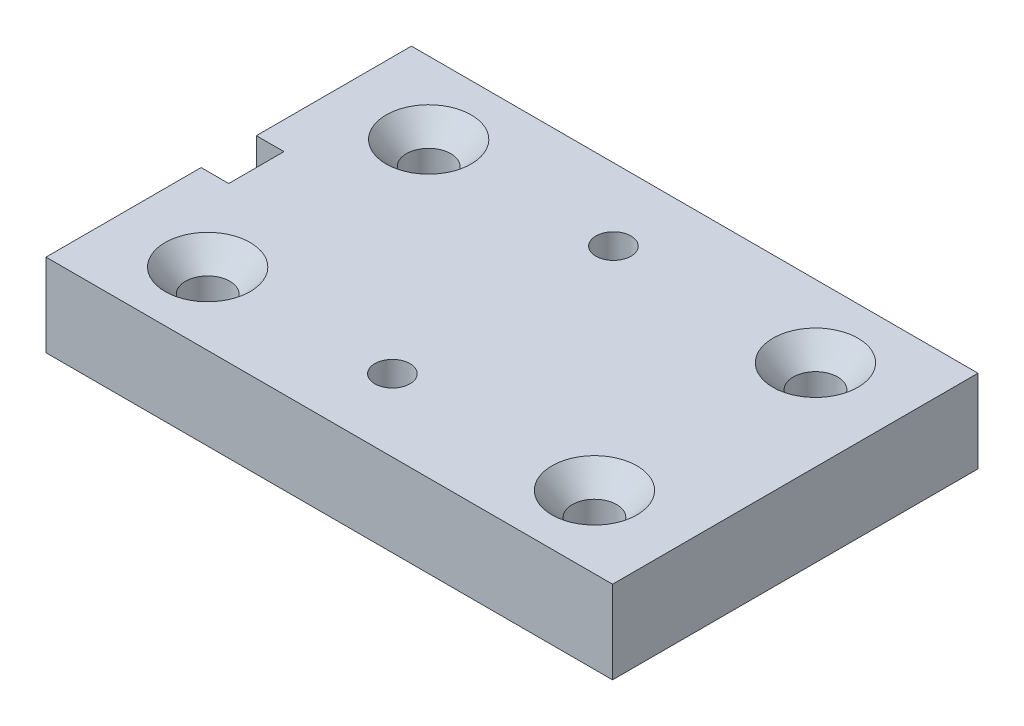
ISO-10303-21;
HEADER;
FILE_DESCRIPTION(('STEP AP214'),'2;1');
FILE_NAME('part.step','',(''),(''),'','','');
FILE_SCHEMA(('AUTOMOTIVE_DESIGN { 1 0 10303 214 1 1 1 1 }'));
ENDSEC;
DATA;
#1=APPLICATION_CONTEXT('core data for automotive mechanical design processes');
#2=APPLICATION_PROTOCOL_DEFINITION('international standard','automotive_design',2000,#1);
#3=PRODUCT_CONTEXT('',#1,'mechanical');
#4=PRODUCT('Part','Part','',(#3));
#5=PRODUCT_RELATED_PRODUCT_CATEGORY('part','',(#4));
#6=PRODUCT_DEFINITION_FORMATION('','',#4);
#7=PRODUCT_DEFINITION_CONTEXT('part definition',#1,'design');
#8=PRODUCT_DEFINITION('design','',#6,#7);
#9=PRODUCT_DEFINITION_SHAPE('','',#8);
#10=(LENGTH_UNIT() NAMED_UNIT(*) SI_UNIT(.MILLI.,.METRE.));
#11=(NAMED_UNIT(*) PLANE_ANGLE_UNIT() SI_UNIT($,.RADIAN.));
#12=(NAMED_UNIT(*) SI_UNIT($,.STERADIAN.) SOLID_ANGLE_UNIT());
#13=UNCERTAINTY_MEASURE_WITH_UNIT(LENGTH_MEASURE(1.E-05),#10,'distance_accuracy_value','');
#14=(GEOMETRIC_REPRESENTATION_CONTEXT(3) GLOBAL_UNCERTAINTY_ASSIGNED_CONTEXT((#13)) GLOBAL_UNIT_ASSIGNED_CONTEXT((#10,
#11,#12)) REPRESENTATION_CONTEXT('',''));
#15=CARTESIAN_POINT('',(0.,0.,0.));
#16=DIRECTION('',(0.,0.,1.));
#17=DIRECTION('',(1.,0.,0.));
#18=AXIS2_PLACEMENT_3D('',#15,#16,#17);
#19=CARTESIAN_POINT('',(-65.110000082,9.525,0.));
#20=DIRECTION('',(1.,0.,0.));
#21=DIRECTION('',(0.,0.,-1.));
#22=AXIS2_PLACEMENT_3D('',#19,#20,#21);
#23=PLANE('',#22);
#24=DIRECTION('',(0.,0.,1.));
#25=VECTOR('',#24,1.);
#26=CARTESIAN_POINT('',(-65.110000082,0.,0.));
#27=LINE('',#26,#25);
#28=CARTESIAN_POINT('',(-65.110000082,0.,-42.));
#29=VERTEX_POINT('',#28);
#30=CARTESIAN_POINT('',(-65.110000082,0.,-24.175));
#31=VERTEX_POINT('',#30);
#32=EDGE_CURVE('E128',#29,#31,#27,.T.);
#33=ORIENTED_EDGE('',*,*,#32,.T.);
#34=DIRECTION('',(0.,1.,0.));
#35=VECTOR('',#34,1.);
#36=CARTESIAN_POINT('',(-65.110000082,0.,-24.175));
#37=LINE('',#36,#35);
#38=CARTESIAN_POINT('',(-65.110000082,9.525,-24.175));
#39=VERTEX_POINT('',#38);
#40=EDGE_CURVE('E161',#31,#39,#37,.T.);
#41=ORIENTED_EDGE('',*,*,#40,.T.);
#42=DIRECTION('',(0.,0.,1.));
#43=VECTOR('',#42,1.);
#44=CARTESIAN_POINT('',(-65.110000082,9.525,0.));
#45=LINE('',#44,#43);
#46=CARTESIAN_POINT('',(-65.110000082,9.525,-42.));
#47=VERTEX_POINT('',#46);
#48=EDGE_CURVE('E147',#47,#39,#45,.T.);
#49=ORIENTED_EDGE('',*,*,#48,.F.);
#50=DIRECTION('',(0.,-1.,0.));
#51=VECTOR('',#50,1.);
#52=CARTESIAN_POINT('',(-65.110000082,9.525,-42.));
#53=LINE('',#52,#51);
#54=EDGE_CURVE('E42',#47,#29,#53,.T.);
#55=ORIENTED_EDGE('',*,*,#54,.T.);
#56=EDGE_LOOP('',(#33,#41,#49,#55));
#57=FACE_BOUND('',#56,.T.);
#58=ADVANCED_FACE('F34',(#57),#23,.F.);
#59=CARTESIAN_POINT('',(0.,9.525,0.));
#60=DIRECTION('',(-1.,0.,0.));
#61=DIRECTION('',(0.,0.,1.));
#62=AXIS2_PLACEMENT_3D('',#59,#60,#61);
#63=PLANE('',#62);
#64=DIRECTION('',(0.,0.,-1.));
#65=VECTOR('',#64,1.);
#66=CARTESIAN_POINT('',(0.,0.,0.));
#67=LINE('',#66,#65);
#68=CARTESIAN_POINT('',(0.,0.,0.));
#69=VERTEX_POINT('',#68);
#70=CARTESIAN_POINT('',(0.,0.,-42.));
#71=VERTEX_POINT('',#70);
#72=EDGE_CURVE('E132',#69,#71,#67,.T.);
#73=ORIENTED_EDGE('',*,*,#72,.T.);
#74=DIRECTION('',(0.,-1.,0.));
#75=VECTOR('',#74,1.);
#76=CARTESIAN_POINT('',(0.,9.525,-42.));
#77=LINE('',#76,#75);
#78=CARTESIAN_POINT('',(0.,9.525,-42.));
#79=VERTEX_POINT('',#78);
#80=EDGE_CURVE('E11',#79,#71,#77,.T.);
#81=ORIENTED_EDGE('',*,*,#80,.F.);
#82=DIRECTION('',(0.,0.,-1.));
#83=VECTOR('',#82,1.);
#84=CARTESIAN_POINT('',(0.,9.525,0.));
#85=LINE('',#84,#83);
#86=CARTESIAN_POINT('',(0.,9.525,0.));
#87=VERTEX_POINT('',#86);
#88=EDGE_CURVE('E137',#87,#79,#85,.T.);
#89=ORIENTED_EDGE('',*,*,#88,.F.);
#90=DIRECTION('',(0.,-1.,0.));
#91=VECTOR('',#90,1.);
#92=CARTESIAN_POINT('',(0.,9.525,0.));
#93=LINE('',#92,#91);
#94=EDGE_CURVE('E138',#87,#69,#93,.T.);
#95=ORIENTED_EDGE('',*,*,#94,.T.);
#96=EDGE_LOOP('',(#73,#81,#89,#95));
#97=FACE_BOUND('',#96,.T.);
#98=ADVANCED_FACE('F36',(#97),#63,.F.);
#99=CARTESIAN_POINT('',(0.,9.525,-42.));
#100=DIRECTION('',(0.,0.,1.));
#101=DIRECTION('',(1.,0.,0.));
#102=AXIS2_PLACEMENT_3D('',#99,#100,#101);
#103=PLANE('',#102);
#104=DIRECTION('',(-1.,0.,0.));
#105=VECTOR('',#104,1.);
#106=CARTESIAN_POINT('',(0.,0.,-42.));
#107=LINE('',#106,#105);
#108=EDGE_CURVE('E129',#71,#29,#107,.T.);
#109=ORIENTED_EDGE('',*,*,#108,.T.);
#110=ORIENTED_EDGE('',*,*,#54,.F.);
#111=DIRECTION('',(-1.,0.,0.));
#112=VECTOR('',#111,1.);
#113=CARTESIAN_POINT('',(0.,9.525,-42.));
#114=LINE('',#113,#112);
#115=EDGE_CURVE('E86',#79,#47,#114,.T.);
#116=ORIENTED_EDGE('',*,*,#115,.F.);
#117=ORIENTED_EDGE('',*,*,#80,.T.);
#118=EDGE_LOOP('',(#109,#110,#116,#117));
#119=FACE_BOUND('',#118,.T.);
#120=ADVANCED_FACE('F219',(#119),#103,.F.);
#121=CARTESIAN_POINT('',(-65.110000082,9.525,-17.825));
#122=VERTEX_POINT('',#121);
#123=CARTESIAN_POINT('',(-65.110000082,9.525,0.));
#124=VERTEX_POINT('',#123);
#125=EDGE_CURVE('E123',#122,#124,#45,.T.);
#126=ORIENTED_EDGE('',*,*,#125,.F.);
#127=DIRECTION('',(0.,1.,0.));
#128=VECTOR('',#127,1.);
#129=CARTESIAN_POINT('',(-65.110000082,0.,-17.825));
#130=LINE('',#129,#128);
#131=CARTESIAN_POINT('',(-65.110000082,0.,-17.825));
#132=VERTEX_POINT('',#131);
#133=EDGE_CURVE('E111',#132,#122,#130,.T.);
#134=ORIENTED_EDGE('',*,*,#133,.F.);
#135=CARTESIAN_POINT('',(-65.110000082,0.,0.));
#136=VERTEX_POINT('',#135);
#137=EDGE_CURVE('E122',#132,#136,#27,.T.);
#138=ORIENTED_EDGE('',*,*,#137,.T.);
#139=DIRECTION('',(0.,-1.,0.));
#140=VECTOR('',#139,1.);
#141=CARTESIAN_POINT('',(-65.110000082,9.525,0.));
#142=LINE('',#141,#140);
#143=EDGE_CURVE('E140',#124,#136,#142,.T.);
#144=ORIENTED_EDGE('',*,*,#143,.F.);
#145=EDGE_LOOP('',(#126,#134,#138,#144));
#146=FACE_BOUND('',#145,.T.);
#147=ADVANCED_FACE('F120',(#146),#23,.F.);
#148=CARTESIAN_POINT('',(0.,9.525,0.));
#149=DIRECTION('',(0.,0.,-1.));
#150=DIRECTION('',(-1.,0.,0.));
#151=AXIS2_PLACEMENT_3D('',#148,#149,#150);
#152=PLANE('',#151);
#153=DIRECTION('',(1.,0.,0.));
#154=VECTOR('',#153,1.);
#155=CARTESIAN_POINT('',(0.,0.,0.));
#156=LINE('',#155,#154);
#157=EDGE_CURVE('E79',#136,#69,#156,.T.);
#158=ORIENTED_EDGE('',*,*,#157,.T.);
#159=ORIENTED_EDGE('',*,*,#94,.F.);
#160=DIRECTION('',(1.,0.,0.));
#161=VECTOR('',#160,1.);
#162=CARTESIAN_POINT('',(0.,9.525,0.));
#163=LINE('',#162,#161);
#164=EDGE_CURVE('E58',#124,#87,#163,.T.);
#165=ORIENTED_EDGE('',*,*,#164,.F.);
#166=ORIENTED_EDGE('',*,*,#143,.T.);
#167=EDGE_LOOP('',(#158,#159,#165,#166));
#168=FACE_BOUND('',#167,.T.);
#169=ADVANCED_FACE('F209',(#168),#152,.F.);
#170=CARTESIAN_POINT('',(0.,9.525,0.));
#171=DIRECTION('',(0.,1.,0.));
#172=DIRECTION('',(0.,0.,1.));
#173=AXIS2_PLACEMENT_3D('',#170,#171,#172);
#174=PLANE('',#173);
#175=CARTESIAN_POINT('',(-33.600000082,9.525,-33.7));
#176=DIRECTION('',(0.,1.,0.));
#177=DIRECTION('',(0.,0.,1.));
#178=AXIS2_PLACEMENT_3D('',#175,#176,#177);
#179=CIRCLE('',#178,2.0193);
#180=CARTESIAN_POINT('',(-33.600000082,9.525,-31.6807));
#181=VERTEX_POINT('',#180);
#182=EDGE_CURVE('E425',#181,#181,#179,.T.);
#183=ORIENTED_EDGE('',*,*,#182,.F.);
#184=EDGE_LOOP('',(#183));
#185=FACE_BOUND('',#184,.T.);
#186=CARTESIAN_POINT('',(-33.600000082,9.525,-8.3));
#187=DIRECTION('',(0.,1.,0.));
#188=DIRECTION('',(0.,0.,1.));
#189=AXIS2_PLACEMENT_3D('',#186,#187,#188);
#190=CIRCLE('',#189,2.0193);
#191=CARTESIAN_POINT('',(-33.600000082,9.525,-6.2807));
#192=VERTEX_POINT('',#191);
#193=EDGE_CURVE('E157',#192,#192,#190,.T.);
#194=ORIENTED_EDGE('',*,*,#193,.F.);
#195=EDGE_LOOP('',(#194));
#196=FACE_BOUND('',#195,.T.);
#197=DIRECTION('',(-1.,0.,0.));
#198=VECTOR('',#197,1.);
#199=CARTESIAN_POINT('',(-65.110000082,9.525,-24.175));
#200=LINE('',#199,#198);
#201=CARTESIAN_POINT('',(-61.935000082,9.525,-24.175));
#202=VERTEX_POINT('',#201);
#203=EDGE_CURVE('E116',#202,#39,#200,.T.);
#204=ORIENTED_EDGE('',*,*,#203,.F.);
#205=DIRECTION('',(0.,0.,-1.));
#206=VECTOR('',#205,1.);
#207=CARTESIAN_POINT('',(-61.935000082,9.525,-24.175));
#208=LINE('',#207,#206);
#209=CARTESIAN_POINT('',(-61.935000082,9.525,-17.825));
#210=VERTEX_POINT('',#209);
#211=EDGE_CURVE('E156',#210,#202,#208,.T.);
#212=ORIENTED_EDGE('',*,*,#211,.F.);
#213=DIRECTION('',(1.,0.,0.));
#214=VECTOR('',#213,1.);
#215=CARTESIAN_POINT('',(-65.110000082,9.525,-17.825));
#216=LINE('',#215,#214);
#217=EDGE_CURVE('E154',#122,#210,#216,.T.);
#218=ORIENTED_EDGE('',*,*,#217,.F.);
#219=ORIENTED_EDGE('',*,*,#125,.T.);
#220=ORIENTED_EDGE('',*,*,#164,.T.);
#221=ORIENTED_EDGE('',*,*,#88,.T.);
#222=ORIENTED_EDGE('',*,*,#115,.T.);
#223=ORIENTED_EDGE('',*,*,#48,.T.);
#224=EDGE_LOOP('',(#204,#212,#218,#219,#220,#221,#222,#223));
#225=FACE_BOUND('',#224,.T.);
#226=CARTESIAN_POINT('',(-54.830000082,9.525,-33.7));
#227=DIRECTION('',(0.,1.,0.));
#228=DIRECTION('',(0.,0.,1.));
#229=AXIS2_PLACEMENT_3D('',#226,#227,#228);
#230=CIRCLE('',#229,4.8895);
#231=CARTESIAN_POINT('',(-54.830000082,9.525,-28.8105));
#232=VERTEX_POINT('',#231);
#233=EDGE_CURVE('E163',#232,#232,#230,.T.);
#234=ORIENTED_EDGE('',*,*,#233,.F.);
#235=EDGE_LOOP('',(#234));
#236=FACE_BOUND('',#235,.T.);
#237=CARTESIAN_POINT('',(-54.830000082,9.525,-8.29999999999999));
#238=DIRECTION('',(0.,1.,0.));
#239=DIRECTION('',(0.,0.,1.));
#240=AXIS2_PLACEMENT_3D('',#237,#238,#239);
#241=CIRCLE('',#240,4.8895);
#242=CARTESIAN_POINT('',(-54.830000082,9.525,-3.41049999999999));
#243=VERTEX_POINT('',#242);
#244=EDGE_CURVE('E175',#243,#243,#241,.T.);
#245=ORIENTED_EDGE('',*,*,#244,.F.);
#246=EDGE_LOOP('',(#245));
#247=FACE_BOUND('',#246,.T.);
#248=CARTESIAN_POINT('',(-10.3799894,9.525,-8.3));
#249=DIRECTION('',(0.,1.,0.));
#250=DIRECTION('',(0.,0.,1.));
#251=AXIS2_PLACEMENT_3D('',#248,#249,#250);
#252=CIRCLE('',#251,4.8895);
#253=CARTESIAN_POINT('',(-10.3799894,9.525,-3.4105));
#254=VERTEX_POINT('',#253);
#255=EDGE_CURVE('E184',#254,#254,#252,.T.);
#256=ORIENTED_EDGE('',*,*,#255,.F.);
#257=EDGE_LOOP('',(#256));
#258=FACE_BOUND('',#257,.T.);
#259=CARTESIAN_POINT('',(-10.3799894,9.525,-33.7));
#260=DIRECTION('',(0.,1.,0.));
#261=DIRECTION('',(0.,0.,1.));
#262=AXIS2_PLACEMENT_3D('',#259,#260,#261);
#263=CIRCLE('',#262,4.8895);
#264=CARTESIAN_POINT('',(-10.3799894,9.525,-28.8105));
#265=VERTEX_POINT('',#264);
#266=EDGE_CURVE('E193',#265,#265,#263,.T.);
#267=ORIENTED_EDGE('',*,*,#266,.F.);
#268=EDGE_LOOP('',(#267));
#269=FACE_BOUND('',#268,.T.);
#270=ADVANCED_FACE('F211',(#185,#196,#225,#236,#247,#258,#269),#174,.T.);
#271=CARTESIAN_POINT('',(0.,0.,0.));
#272=DIRECTION('',(0.,1.,0.));
#273=DIRECTION('',(0.,0.,1.));
#274=AXIS2_PLACEMENT_3D('',#271,#272,#273);
#275=PLANE('',#274);
#276=CARTESIAN_POINT('',(-33.600000082,0.,-33.7));
#277=DIRECTION('',(0.,1.,0.));
#278=DIRECTION('',(0.,0.,1.));
#279=AXIS2_PLACEMENT_3D('',#276,#277,#278);
#280=CIRCLE('',#279,2.0193);
#281=CARTESIAN_POINT('',(-33.600000082,0.,-31.6807));
#282=VERTEX_POINT('',#281);
#283=EDGE_CURVE('E422',#282,#282,#280,.T.);
#284=ORIENTED_EDGE('',*,*,#283,.T.);
#285=EDGE_LOOP('',(#284));
#286=FACE_BOUND('',#285,.T.);
#287=CARTESIAN_POINT('',(-33.600000082,0.,-8.3));
#288=DIRECTION('',(0.,1.,0.));
#289=DIRECTION('',(0.,0.,1.));
#290=AXIS2_PLACEMENT_3D('',#287,#288,#289);
#291=CIRCLE('',#290,2.0193);
#292=CARTESIAN_POINT('',(-33.600000082,0.,-6.2807));
#293=VERTEX_POINT('',#292);
#294=EDGE_CURVE('E426',#293,#293,#291,.T.);
#295=ORIENTED_EDGE('',*,*,#294,.T.);
#296=EDGE_LOOP('',(#295));
#297=FACE_BOUND('',#296,.T.);
#298=CARTESIAN_POINT('',(-54.830000082,0.,-33.7));
#299=DIRECTION('',(0.,1.,0.));
#300=DIRECTION('',(0.,0.,1.));
#301=AXIS2_PLACEMENT_3D('',#298,#299,#300);
#302=CIRCLE('',#301,2.5527);
#303=CARTESIAN_POINT('',(-54.830000082,0.,-31.1473));
#304=VERTEX_POINT('',#303);
#305=EDGE_CURVE('E172',#304,#304,#302,.T.);
#306=ORIENTED_EDGE('',*,*,#305,.T.);
#307=EDGE_LOOP('',(#306));
#308=FACE_BOUND('',#307,.T.);
#309=CARTESIAN_POINT('',(-54.830000082,0.,-8.29999999999999));
#310=DIRECTION('',(0.,1.,0.));
#311=DIRECTION('',(0.,0.,1.));
#312=AXIS2_PLACEMENT_3D('',#309,#310,#311);
#313=CIRCLE('',#312,2.5527);
#314=CARTESIAN_POINT('',(-54.830000082,0.,-5.74729999999999));
#315=VERTEX_POINT('',#314);
#316=EDGE_CURVE('E181',#315,#315,#313,.T.);
#317=ORIENTED_EDGE('',*,*,#316,.T.);
#318=EDGE_LOOP('',(#317));
#319=FACE_BOUND('',#318,.T.);
#320=CARTESIAN_POINT('',(-10.3799894,0.,-8.3));
#321=DIRECTION('',(0.,1.,0.));
#322=DIRECTION('',(0.,0.,1.));
#323=AXIS2_PLACEMENT_3D('',#320,#321,#322);
#324=CIRCLE('',#323,2.5527);
#325=CARTESIAN_POINT('',(-10.3799894,0.,-5.7473));
#326=VERTEX_POINT('',#325);
#327=EDGE_CURVE('E190',#326,#326,#324,.T.);
#328=ORIENTED_EDGE('',*,*,#327,.T.);
#329=EDGE_LOOP('',(#328));
#330=FACE_BOUND('',#329,.T.);
#331=CARTESIAN_POINT('',(-10.3799894,0.,-33.7));
#332=DIRECTION('',(0.,1.,0.));
#333=DIRECTION('',(0.,0.,1.));
#334=AXIS2_PLACEMENT_3D('',#331,#332,#333);
#335=CIRCLE('',#334,2.5527);
#336=CARTESIAN_POINT('',(-10.3799894,0.,-31.1473));
#337=VERTEX_POINT('',#336);
#338=EDGE_CURVE('E199',#337,#337,#335,.T.);
#339=ORIENTED_EDGE('',*,*,#338,.T.);
#340=EDGE_LOOP('',(#339));
#341=FACE_BOUND('',#340,.T.);
#342=DIRECTION('',(0.,0.,-1.));
#343=VECTOR('',#342,1.);
#344=CARTESIAN_POINT('',(-61.935000082,0.,-24.175));
#345=LINE('',#344,#343);
#346=CARTESIAN_POINT('',(-61.935000082,0.,-17.825));
#347=VERTEX_POINT('',#346);
#348=CARTESIAN_POINT('',(-61.935000082,0.,-24.175));
#349=VERTEX_POINT('',#348);
#350=EDGE_CURVE('E49',#347,#349,#345,.T.);
#351=ORIENTED_EDGE('',*,*,#350,.T.);
#352=DIRECTION('',(-1.,0.,0.));
#353=VECTOR('',#352,1.);
#354=CARTESIAN_POINT('',(-65.110000082,0.,-24.175));
#355=LINE('',#354,#353);
#356=EDGE_CURVE('E124',#349,#31,#355,.T.);
#357=ORIENTED_EDGE('',*,*,#356,.T.);
#358=ORIENTED_EDGE('',*,*,#32,.F.);
#359=ORIENTED_EDGE('',*,*,#108,.F.);
#360=ORIENTED_EDGE('',*,*,#72,.F.);
#361=ORIENTED_EDGE('',*,*,#157,.F.);
#362=ORIENTED_EDGE('',*,*,#137,.F.);
#363=DIRECTION('',(1.,0.,0.));
#364=VECTOR('',#363,1.);
#365=CARTESIAN_POINT('',(-65.110000082,0.,-17.825));
#366=LINE('',#365,#364);
#367=EDGE_CURVE('E107',#132,#347,#366,.T.);
#368=ORIENTED_EDGE('',*,*,#367,.T.);
#369=EDGE_LOOP('',(#351,#357,#358,#359,#360,#361,#362,#368));
#370=FACE_BOUND('',#369,.T.);
#371=ADVANCED_FACE('F126',(#286,#297,#308,#319,#330,#341,#370),#275,.F.);
#372=CARTESIAN_POINT('',(-10.3799894,9.525,-33.7));
#373=DIRECTION('',(0.,1.,0.));
#374=DIRECTION('',(0.,0.,1.));
#375=AXIS2_PLACEMENT_3D('',#372,#373,#374);
#376=CYLINDRICAL_SURFACE('',#375,2.5527);
#377=ORIENTED_EDGE('',*,*,#338,.F.);
#378=EDGE_LOOP('',(#377));
#379=FACE_BOUND('',#378,.T.);
#380=CARTESIAN_POINT('',(-10.3799894,6.83681910600595,-33.7));
#381=DIRECTION('',(0.,1.,0.));
#382=DIRECTION('',(0.,0.,1.));
#383=AXIS2_PLACEMENT_3D('',#380,#381,#382);
#384=CIRCLE('',#383,2.5527);
#385=CARTESIAN_POINT('',(-10.3799894,6.83681910600595,-31.1473));
#386=VERTEX_POINT('',#385);
#387=EDGE_CURVE('E196',#386,#386,#384,.T.);
#388=ORIENTED_EDGE('',*,*,#387,.T.);
#389=EDGE_LOOP('',(#388));
#390=FACE_BOUND('',#389,.T.);
#391=ADVANCED_FACE('F285',(#379,#390),#376,.F.);
#392=CARTESIAN_POINT('',(-10.3799894,9.525,-33.7));
#393=DIRECTION('',(0.,1.,0.));
#394=DIRECTION('',(0.,0.,1.));
#395=AXIS2_PLACEMENT_3D('',#392,#393,#394);
#396=CONICAL_SURFACE('',#395,4.8895,0.715584993317675);
#397=ORIENTED_EDGE('',*,*,#387,.F.);
#398=EDGE_LOOP('',(#397));
#399=FACE_BOUND('',#398,.T.);
#400=ORIENTED_EDGE('',*,*,#266,.T.);
#401=EDGE_LOOP('',(#400));
#402=FACE_BOUND('',#401,.T.);
#403=ADVANCED_FACE('F336',(#399,#402),#396,.F.);
#404=CARTESIAN_POINT('',(-10.3799894,9.525,-8.3));
#405=DIRECTION('',(0.,1.,0.));
#406=DIRECTION('',(0.,0.,1.));
#407=AXIS2_PLACEMENT_3D('',#404,#405,#406);
#408=CYLINDRICAL_SURFACE('',#407,2.5527);
#409=ORIENTED_EDGE('',*,*,#327,.F.);
#410=EDGE_LOOP('',(#409));
#411=FACE_BOUND('',#410,.T.);
#412=CARTESIAN_POINT('',(-10.3799894,6.83681910600595,-8.3));
#413=DIRECTION('',(0.,1.,0.));
#414=DIRECTION('',(0.,0.,1.));
#415=AXIS2_PLACEMENT_3D('',#412,#413,#414);
#416=CIRCLE('',#415,2.5527);
#417=CARTESIAN_POINT('',(-10.3799894,6.83681910600595,-5.7473));
#418=VERTEX_POINT('',#417);
#419=EDGE_CURVE('E187',#418,#418,#416,.T.);
#420=ORIENTED_EDGE('',*,*,#419,.T.);
#421=EDGE_LOOP('',(#420));
#422=FACE_BOUND('',#421,.T.);
#423=ADVANCED_FACE('F332',(#411,#422),#408,.F.);
#424=CARTESIAN_POINT('',(-10.3799894,9.525,-8.3));
#425=DIRECTION('',(0.,1.,0.));
#426=DIRECTION('',(0.,0.,1.));
#427=AXIS2_PLACEMENT_3D('',#424,#425,#426);
#428=CONICAL_SURFACE('',#427,4.8895,0.715584993317675);
#429=ORIENTED_EDGE('',*,*,#419,.F.);
#430=EDGE_LOOP('',(#429));
#431=FACE_BOUND('',#430,.T.);
#432=ORIENTED_EDGE('',*,*,#255,.T.);
#433=EDGE_LOOP('',(#432));
#434=FACE_BOUND('',#433,.T.);
#435=ADVANCED_FACE('F328',(#431,#434),#428,.F.);
#436=CARTESIAN_POINT('',(-54.830000082,9.525,-8.29999999999999));
#437=DIRECTION('',(0.,1.,0.));
#438=DIRECTION('',(0.,0.,1.));
#439=AXIS2_PLACEMENT_3D('',#436,#437,#438);
#440=CYLINDRICAL_SURFACE('',#439,2.5527);
#441=ORIENTED_EDGE('',*,*,#316,.F.);
#442=EDGE_LOOP('',(#441));
#443=FACE_BOUND('',#442,.T.);
#444=CARTESIAN_POINT('',(-54.830000082,6.83681910600595,-8.29999999999999));
#445=DIRECTION('',(0.,1.,0.));
#446=DIRECTION('',(0.,0.,1.));
#447=AXIS2_PLACEMENT_3D('',#444,#445,#446);
#448=CIRCLE('',#447,2.5527);
#449=CARTESIAN_POINT('',(-54.830000082,6.83681910600595,-5.74729999999999));
#450=VERTEX_POINT('',#449);
#451=EDGE_CURVE('E178',#450,#450,#448,.T.);
#452=ORIENTED_EDGE('',*,*,#451,.T.);
#453=EDGE_LOOP('',(#452));
#454=FACE_BOUND('',#453,.T.);
#455=ADVANCED_FACE('F324',(#443,#454),#440,.F.);
#456=CARTESIAN_POINT('',(-54.830000082,9.525,-8.29999999999999));
#457=DIRECTION('',(0.,1.,0.));
#458=DIRECTION('',(0.,0.,1.));
#459=AXIS2_PLACEMENT_3D('',#456,#457,#458);
#460=CONICAL_SURFACE('',#459,4.8895,0.715584993317675);
#461=ORIENTED_EDGE('',*,*,#451,.F.);
#462=EDGE_LOOP('',(#461));
#463=FACE_BOUND('',#462,.T.);
#464=ORIENTED_EDGE('',*,*,#244,.T.);
#465=EDGE_LOOP('',(#464));
#466=FACE_BOUND('',#465,.T.);
#467=ADVANCED_FACE('F320',(#463,#466),#460,.F.);
#468=CARTESIAN_POINT('',(-54.830000082,9.525,-33.7));
#469=DIRECTION('',(0.,1.,0.));
#470=DIRECTION('',(0.,0.,1.));
#471=AXIS2_PLACEMENT_3D('',#468,#469,#470);
#472=CYLINDRICAL_SURFACE('',#471,2.5527);
#473=ORIENTED_EDGE('',*,*,#305,.F.);
#474=EDGE_LOOP('',(#473));
#475=FACE_BOUND('',#474,.T.);
#476=CARTESIAN_POINT('',(-54.830000082,6.83681910600595,-33.7));
#477=DIRECTION('',(0.,1.,0.));
#478=DIRECTION('',(0.,0.,1.));
#479=AXIS2_PLACEMENT_3D('',#476,#477,#478);
#480=CIRCLE('',#479,2.5527);
#481=CARTESIAN_POINT('',(-54.830000082,6.83681910600595,-31.1473));
#482=VERTEX_POINT('',#481);
#483=EDGE_CURVE('E169',#482,#482,#480,.T.);
#484=ORIENTED_EDGE('',*,*,#483,.T.);
#485=EDGE_LOOP('',(#484));
#486=FACE_BOUND('',#485,.T.);
#487=ADVANCED_FACE('F316',(#475,#486),#472,.F.);
#488=CARTESIAN_POINT('',(-54.830000082,9.525,-33.7));
#489=DIRECTION('',(0.,1.,0.));
#490=DIRECTION('',(0.,0.,1.));
#491=AXIS2_PLACEMENT_3D('',#488,#489,#490);
#492=CONICAL_SURFACE('',#491,4.8895,0.715584993317675);
#493=ORIENTED_EDGE('',*,*,#483,.F.);
#494=EDGE_LOOP('',(#493));
#495=FACE_BOUND('',#494,.T.);
#496=ORIENTED_EDGE('',*,*,#233,.T.);
#497=EDGE_LOOP('',(#496));
#498=FACE_BOUND('',#497,.T.);
#499=ADVANCED_FACE('F250',(#495,#498),#492,.F.);
#500=CARTESIAN_POINT('',(-65.110000082,0.,-24.175));
#501=DIRECTION('',(0.,0.,-1.));
#502=DIRECTION('',(-1.,0.,0.));
#503=AXIS2_PLACEMENT_3D('',#500,#501,#502);
#504=PLANE('',#503);
#505=ORIENTED_EDGE('',*,*,#203,.T.);
#506=ORIENTED_EDGE('',*,*,#40,.F.);
#507=ORIENTED_EDGE('',*,*,#356,.F.);
#508=DIRECTION('',(0.,1.,0.));
#509=VECTOR('',#508,1.);
#510=CARTESIAN_POINT('',(-61.935000082,0.,-24.175));
#511=LINE('',#510,#509);
#512=EDGE_CURVE('E164',#349,#202,#511,.T.);
#513=ORIENTED_EDGE('',*,*,#512,.T.);
#514=EDGE_LOOP('',(#505,#506,#507,#513));
#515=FACE_BOUND('',#514,.T.);
#516=ADVANCED_FACE('F244',(#515),#504,.F.);
#517=CARTESIAN_POINT('',(-61.935000082,0.,-24.175));
#518=DIRECTION('',(1.,0.,0.));
#519=DIRECTION('',(0.,0.,-1.));
#520=AXIS2_PLACEMENT_3D('',#517,#518,#519);
#521=PLANE('',#520);
#522=ORIENTED_EDGE('',*,*,#211,.T.);
#523=ORIENTED_EDGE('',*,*,#512,.F.);
#524=ORIENTED_EDGE('',*,*,#350,.F.);
#525=DIRECTION('',(0.,1.,0.));
#526=VECTOR('',#525,1.);
#527=CARTESIAN_POINT('',(-61.935000082,0.,-17.825));
#528=LINE('',#527,#526);
#529=EDGE_CURVE('E113',#347,#210,#528,.T.);
#530=ORIENTED_EDGE('',*,*,#529,.T.);
#531=EDGE_LOOP('',(#522,#523,#524,#530));
#532=FACE_BOUND('',#531,.T.);
#533=ADVANCED_FACE('F249',(#532),#521,.F.);
#534=CARTESIAN_POINT('',(-65.110000082,0.,-17.825));
#535=DIRECTION('',(0.,0.,1.));
#536=DIRECTION('',(1.,0.,0.));
#537=AXIS2_PLACEMENT_3D('',#534,#535,#536);
#538=PLANE('',#537);
#539=ORIENTED_EDGE('',*,*,#217,.T.);
#540=ORIENTED_EDGE('',*,*,#529,.F.);
#541=ORIENTED_EDGE('',*,*,#367,.F.);
#542=ORIENTED_EDGE('',*,*,#133,.T.);
#543=EDGE_LOOP('',(#539,#540,#541,#542));
#544=FACE_BOUND('',#543,.T.);
#545=ADVANCED_FACE('F110',(#544),#538,.F.);
#546=CARTESIAN_POINT('',(-33.600000082,9.525,-8.3));
#547=DIRECTION('',(0.,1.,0.));
#548=DIRECTION('',(0.,0.,1.));
#549=AXIS2_PLACEMENT_3D('',#546,#547,#548);
#550=CYLINDRICAL_SURFACE('',#549,2.0193);
#551=ORIENTED_EDGE('',*,*,#294,.F.);
#552=EDGE_LOOP('',(#551));
#553=FACE_BOUND('',#552,.T.);
#554=ORIENTED_EDGE('',*,*,#193,.T.);
#555=EDGE_LOOP('',(#554));
#556=FACE_BOUND('',#555,.T.);
#557=ADVANCED_FACE('F268',(#553,#556),#550,.F.);
#558=CARTESIAN_POINT('',(-33.600000082,9.525,-33.7));
#559=DIRECTION('',(0.,1.,0.));
#560=DIRECTION('',(0.,0.,1.));
#561=AXIS2_PLACEMENT_3D('',#558,#559,#560);
#562=CYLINDRICAL_SURFACE('',#561,2.0193);
#563=ORIENTED_EDGE('',*,*,#283,.F.);
#564=EDGE_LOOP('',(#563));
#565=FACE_BOUND('',#564,.T.);
#566=ORIENTED_EDGE('',*,*,#182,.T.);
#567=EDGE_LOOP('',(#566));
#568=FACE_BOUND('',#567,.T.);
#569=ADVANCED_FACE('F295',(#565,#568),#562,.F.);
#570=CLOSED_SHELL('',(#58,#98,#120,#147,#169,#270,#371,#391,#403,#423,#435,#455,#467,#487,#499,
#516,#533,#545,#557,#569));
#571=MANIFOLD_SOLID_BREP('B2',#570);
#572=ADVANCED_BREP_SHAPE_REPRESENTATION('',(#18,#571),#14);
#573=SHAPE_DEFINITION_REPRESENTATION(#9,#572);
ENDSEC;
END-ISO-10303-21;
